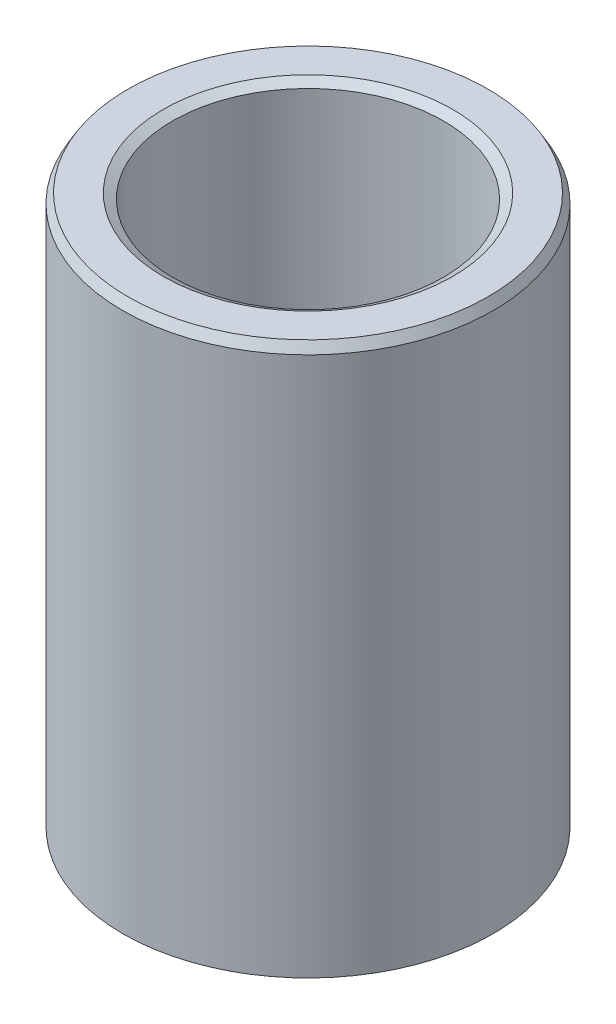
ISO-10303-21;
HEADER;
FILE_DESCRIPTION(('STEP AP214'),'2;1');
FILE_NAME('part.step','',(''),(''),'','','');
FILE_SCHEMA(('AUTOMOTIVE_DESIGN { 1 0 10303 214 1 1 1 1 }'));
ENDSEC;
DATA;
#1=APPLICATION_CONTEXT('core data for automotive mechanical design processes');
#2=APPLICATION_PROTOCOL_DEFINITION('international standard','automotive_design',2000,#1);
#3=PRODUCT_CONTEXT('',#1,'mechanical');
#4=PRODUCT('Part','Part','',(#3));
#5=PRODUCT_RELATED_PRODUCT_CATEGORY('part','',(#4));
#6=PRODUCT_DEFINITION_FORMATION('','',#4);
#7=PRODUCT_DEFINITION_CONTEXT('part definition',#1,'design');
#8=PRODUCT_DEFINITION('design','',#6,#7);
#9=PRODUCT_DEFINITION_SHAPE('','',#8);
#10=(LENGTH_UNIT() NAMED_UNIT(*) SI_UNIT(.MILLI.,.METRE.));
#11=(NAMED_UNIT(*) PLANE_ANGLE_UNIT() SI_UNIT($,.RADIAN.));
#12=(NAMED_UNIT(*) SI_UNIT($,.STERADIAN.) SOLID_ANGLE_UNIT());
#13=UNCERTAINTY_MEASURE_WITH_UNIT(LENGTH_MEASURE(1.E-05),#10,'distance_accuracy_value','');
#14=(GEOMETRIC_REPRESENTATION_CONTEXT(3) GLOBAL_UNCERTAINTY_ASSIGNED_CONTEXT((#13)) GLOBAL_UNIT_ASSIGNED_CONTEXT((#10,
#11,#12)) REPRESENTATION_CONTEXT('',''));
#15=CARTESIAN_POINT('',(0.,0.,0.));
#16=DIRECTION('',(0.,0.,1.));
#17=DIRECTION('',(1.,0.,0.));
#18=AXIS2_PLACEMENT_3D('',#15,#16,#17);
#19=CARTESIAN_POINT('',(0.,104.685781088626,0.));
#20=DIRECTION('',(0.,-1.,0.));
#21=DIRECTION('',(0.,0.,-1.));
#22=AXIS2_PLACEMENT_3D('',#19,#20,#21);
#23=CYLINDRICAL_SURFACE('',#22,35.);
#24=CARTESIAN_POINT('',(0.,1.00869607424467,0.));
#25=DIRECTION('',(0.,1.,0.));
#26=DIRECTION('',(0.,0.,1.));
#27=AXIS2_PLACEMENT_3D('',#24,#25,#26);
#28=CIRCLE('',#27,35.);
#29=CARTESIAN_POINT('',(0.,1.00869607424467,35.));
#30=VERTEX_POINT('',#29);
#31=EDGE_CURVE('E10',#30,#30,#28,.T.);
#32=ORIENTED_EDGE('',*,*,#31,.T.);
#33=EDGE_LOOP('',(#32));
#34=FACE_BOUND('',#33,.T.);
#35=CARTESIAN_POINT('',(0.,102.938668238639,0.));
#36=DIRECTION('',(0.,1.,0.));
#37=DIRECTION('',(0.,0.,1.));
#38=AXIS2_PLACEMENT_3D('',#35,#36,#37);
#39=CIRCLE('',#38,35.);
#40=CARTESIAN_POINT('',(0.,102.938668238639,35.));
#41=VERTEX_POINT('',#40);
#42=EDGE_CURVE('E50',#41,#41,#39,.F.);
#43=ORIENTED_EDGE('',*,*,#42,.T.);
#44=EDGE_LOOP('',(#43));
#45=FACE_BOUND('',#44,.T.);
#46=ADVANCED_FACE('F39',(#34,#45),#23,.T.);
#47=CARTESIAN_POINT('',(0.,104.685781088626,0.));
#48=DIRECTION('',(0.,1.,0.));
#49=DIRECTION('',(0.,0.,1.));
#50=AXIS2_PLACEMENT_3D('',#47,#48,#49);
#51=PLANE('',#50);
#52=CARTESIAN_POINT('',(0.,104.685781088626,0.));
#53=DIRECTION('',(0.,1.,0.));
#54=DIRECTION('',(0.,0.,1.));
#55=AXIS2_PLACEMENT_3D('',#52,#53,#54);
#56=CIRCLE('',#55,27.3398237270307);
#57=CARTESIAN_POINT('',(0.,104.685781088626,27.3398237270307));
#58=VERTEX_POINT('',#57);
#59=EDGE_CURVE('E58',#58,#58,#56,.F.);
#60=ORIENTED_EDGE('',*,*,#59,.T.);
#61=EDGE_LOOP('',(#60));
#62=FACE_BOUND('',#61,.T.);
#63=CARTESIAN_POINT('',(0.,104.685781088626,0.));
#64=DIRECTION('',(0.,1.,0.));
#65=DIRECTION('',(0.,0.,1.));
#66=AXIS2_PLACEMENT_3D('',#63,#64,#65);
#67=CIRCLE('',#66,33.9913039257553);
#68=CARTESIAN_POINT('',(0.,104.685781088626,33.9913039257553));
#69=VERTEX_POINT('',#68);
#70=EDGE_CURVE('E61',#69,#69,#67,.T.);
#71=ORIENTED_EDGE('',*,*,#70,.T.);
#72=EDGE_LOOP('',(#71));
#73=FACE_BOUND('',#72,.T.);
#74=ADVANCED_FACE('F88',(#62,#73),#51,.T.);
#75=CARTESIAN_POINT('',(0.,0.,0.));
#76=DIRECTION('',(0.,1.,0.));
#77=DIRECTION('',(0.,0.,1.));
#78=AXIS2_PLACEMENT_3D('',#75,#76,#77);
#79=PLANE('',#78);
#80=CARTESIAN_POINT('',(0.,0.,0.));
#81=DIRECTION('',(0.,1.,0.));
#82=DIRECTION('',(0.,0.,1.));
#83=AXIS2_PLACEMENT_3D('',#80,#81,#82);
#84=CIRCLE('',#83,26.6014069512883);
#85=CARTESIAN_POINT('',(0.,0.,26.6014069512883));
#86=VERTEX_POINT('',#85);
#87=EDGE_CURVE('E51',#86,#86,#84,.T.);
#88=ORIENTED_EDGE('',*,*,#87,.T.);
#89=EDGE_LOOP('',(#88));
#90=FACE_BOUND('',#89,.T.);
#91=CARTESIAN_POINT('',(0.,0.,0.));
#92=DIRECTION('',(0.,1.,0.));
#93=DIRECTION('',(0.,0.,1.));
#94=AXIS2_PLACEMENT_3D('',#91,#92,#93);
#95=CIRCLE('',#94,33.252887150013);
#96=CARTESIAN_POINT('',(0.,0.,33.252887150013));
#97=VERTEX_POINT('',#96);
#98=EDGE_CURVE('E54',#97,#97,#95,.F.);
#99=ORIENTED_EDGE('',*,*,#98,.T.);
#100=EDGE_LOOP('',(#99));
#101=FACE_BOUND('',#100,.T.);
#102=ADVANCED_FACE('F83',(#90,#101),#79,.F.);
#103=CARTESIAN_POINT('',(0.,104.685781088626,0.));
#104=DIRECTION('',(0.,-1.,0.));
#105=DIRECTION('',(0.,0.,-1.));
#106=AXIS2_PLACEMENT_3D('',#103,#104,#105);
#107=CYLINDRICAL_SURFACE('',#106,25.5927108770437);
#108=CARTESIAN_POINT('',(0.,103.677085014382,0.));
#109=DIRECTION('',(0.,1.,0.));
#110=DIRECTION('',(0.,0.,1.));
#111=AXIS2_PLACEMENT_3D('',#108,#109,#110);
#112=CIRCLE('',#111,25.5927108770437);
#113=CARTESIAN_POINT('',(0.,103.677085014382,25.5927108770437));
#114=VERTEX_POINT('',#113);
#115=EDGE_CURVE('E67',#114,#114,#112,.T.);
#116=ORIENTED_EDGE('',*,*,#115,.T.);
#117=EDGE_LOOP('',(#116));
#118=FACE_BOUND('',#117,.T.);
#119=CARTESIAN_POINT('',(0.,1.74711284998703,0.));
#120=DIRECTION('',(0.,1.,0.));
#121=DIRECTION('',(0.,0.,1.));
#122=AXIS2_PLACEMENT_3D('',#119,#120,#121);
#123=CIRCLE('',#122,25.5927108770437);
#124=CARTESIAN_POINT('',(0.,1.74711284998703,25.5927108770437));
#125=VERTEX_POINT('',#124);
#126=EDGE_CURVE('E69',#125,#125,#123,.F.);
#127=ORIENTED_EDGE('',*,*,#126,.T.);
#128=EDGE_LOOP('',(#127));
#129=FACE_BOUND('',#128,.T.);
#130=ADVANCED_FACE('F71',(#118,#129),#107,.F.);
#131=CARTESIAN_POINT('',(0.,103.677085014382,0.));
#132=DIRECTION('',(0.,1.,0.));
#133=DIRECTION('',(0.,0.,1.));
#134=AXIS2_PLACEMENT_3D('',#131,#132,#133);
#135=CONICAL_SURFACE('',#134,25.5927108770437,1.0471975511966);
#136=ORIENTED_EDGE('',*,*,#59,.F.);
#137=EDGE_LOOP('',(#136));
#138=FACE_BOUND('',#137,.T.);
#139=ORIENTED_EDGE('',*,*,#115,.F.);
#140=EDGE_LOOP('',(#139));
#141=FACE_BOUND('',#140,.T.);
#142=ADVANCED_FACE('F77',(#138,#141),#135,.F.);
#143=CARTESIAN_POINT('',(0.,0.,0.));
#144=DIRECTION('',(0.,-1.,0.));
#145=DIRECTION('',(0.,0.,-1.));
#146=AXIS2_PLACEMENT_3D('',#143,#144,#145);
#147=CONICAL_SURFACE('',#146,26.6014069512883,0.523598775598296);
#148=ORIENTED_EDGE('',*,*,#126,.F.);
#149=EDGE_LOOP('',(#148));
#150=FACE_BOUND('',#149,.T.);
#151=ORIENTED_EDGE('',*,*,#87,.F.);
#152=EDGE_LOOP('',(#151));
#153=FACE_BOUND('',#152,.T.);
#154=ADVANCED_FACE('F73',(#150,#153),#147,.F.);
#155=CARTESIAN_POINT('',(0.,1.00869607424467,0.));
#156=DIRECTION('',(0.,1.,0.));
#157=DIRECTION('',(0.,0.,1.));
#158=AXIS2_PLACEMENT_3D('',#155,#156,#157);
#159=CONICAL_SURFACE('',#158,35.,1.0471975511966);
#160=ORIENTED_EDGE('',*,*,#98,.F.);
#161=EDGE_LOOP('',(#160));
#162=FACE_BOUND('',#161,.T.);
#163=ORIENTED_EDGE('',*,*,#31,.F.);
#164=EDGE_LOOP('',(#163));
#165=FACE_BOUND('',#164,.T.);
#166=ADVANCED_FACE('F76',(#162,#165),#159,.T.);
#167=CARTESIAN_POINT('',(0.,104.685781088626,0.));
#168=DIRECTION('',(0.,-1.,0.));
#169=DIRECTION('',(0.,0.,-1.));
#170=AXIS2_PLACEMENT_3D('',#167,#168,#169);
#171=CONICAL_SURFACE('',#170,33.9913039257553,0.523598775598296);
#172=ORIENTED_EDGE('',*,*,#42,.F.);
#173=EDGE_LOOP('',(#172));
#174=FACE_BOUND('',#173,.T.);
#175=ORIENTED_EDGE('',*,*,#70,.F.);
#176=EDGE_LOOP('',(#175));
#177=FACE_BOUND('',#176,.T.);
#178=ADVANCED_FACE('F45',(#174,#177),#171,.T.);
#179=CLOSED_SHELL('',(#46,#74,#102,#130,#142,#154,#166,#178));
#180=MANIFOLD_SOLID_BREP('B2',#179);
#181=ADVANCED_BREP_SHAPE_REPRESENTATION('',(#18,#180),#14);
#182=SHAPE_DEFINITION_REPRESENTATION(#9,#181);
ENDSEC;
END-ISO-10303-21;
